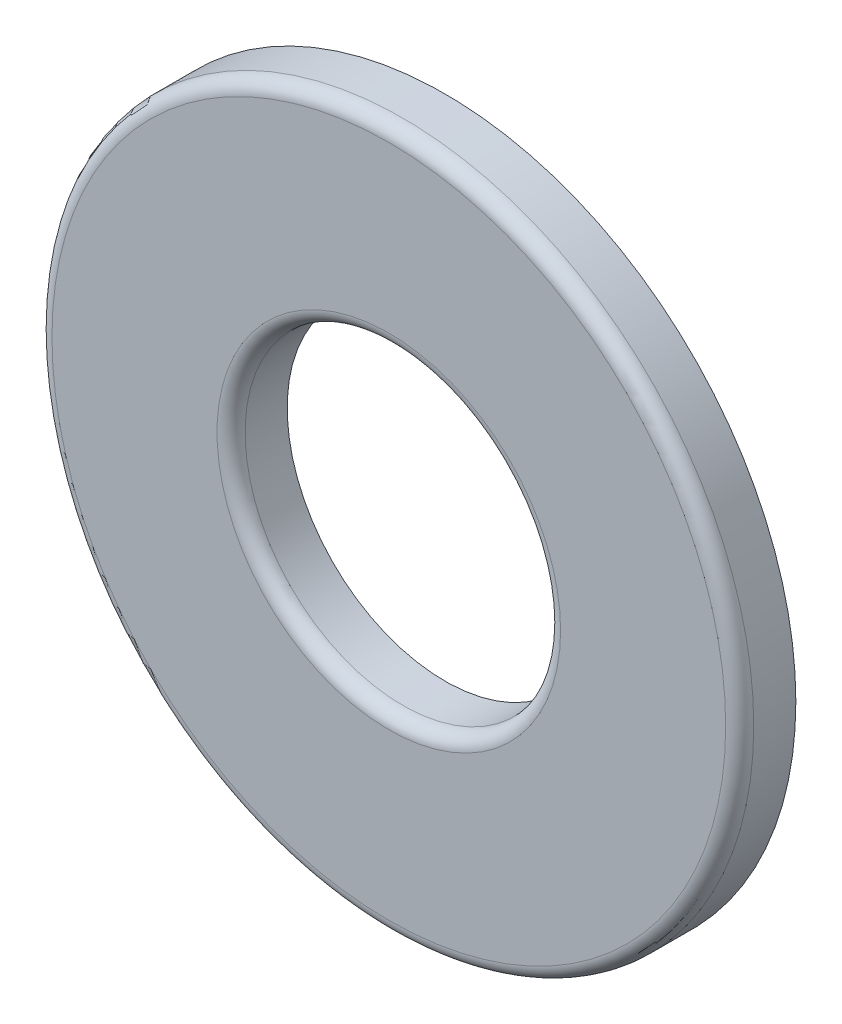
ISO-10303-21;
HEADER;
FILE_DESCRIPTION(('STEP AP214'),'2;1');
FILE_NAME('part.step','',(''),(''),'','','');
FILE_SCHEMA(('AUTOMOTIVE_DESIGN { 1 0 10303 214 1 1 1 1 }'));
ENDSEC;
DATA;
#1=APPLICATION_CONTEXT('core data for automotive mechanical design processes');
#2=APPLICATION_PROTOCOL_DEFINITION('international standard','automotive_design',2000,#1);
#3=PRODUCT_CONTEXT('',#1,'mechanical');
#4=PRODUCT('Part','Part','',(#3));
#5=PRODUCT_RELATED_PRODUCT_CATEGORY('part','',(#4));
#6=PRODUCT_DEFINITION_FORMATION('','',#4);
#7=PRODUCT_DEFINITION_CONTEXT('part definition',#1,'design');
#8=PRODUCT_DEFINITION('design','',#6,#7);
#9=PRODUCT_DEFINITION_SHAPE('','',#8);
#10=(LENGTH_UNIT() NAMED_UNIT(*) SI_UNIT(.MILLI.,.METRE.));
#11=(NAMED_UNIT(*) PLANE_ANGLE_UNIT() SI_UNIT($,.RADIAN.));
#12=(NAMED_UNIT(*) SI_UNIT($,.STERADIAN.) SOLID_ANGLE_UNIT());
#13=UNCERTAINTY_MEASURE_WITH_UNIT(LENGTH_MEASURE(1.E-05),#10,'distance_accuracy_value','');
#14=(GEOMETRIC_REPRESENTATION_CONTEXT(3) GLOBAL_UNCERTAINTY_ASSIGNED_CONTEXT((#13)) GLOBAL_UNIT_ASSIGNED_CONTEXT((#10,
#11,#12)) REPRESENTATION_CONTEXT('',''));
#15=CARTESIAN_POINT('',(0.,0.,0.));
#16=DIRECTION('',(0.,0.,1.));
#17=DIRECTION('',(1.,0.,0.));
#18=AXIS2_PLACEMENT_3D('',#15,#16,#17);
#19=CARTESIAN_POINT('',(0.,0.,0.634999999999997));
#20=DIRECTION('',(0.,0.,1.));
#21=DIRECTION('',(1.,0.,0.));
#22=AXIS2_PLACEMENT_3D('',#19,#20,#21);
#23=PLANE('',#22);
#24=CARTESIAN_POINT('',(0.,0.,0.634999999999997));
#25=DIRECTION('',(0.,0.,1.));
#26=DIRECTION('',(1.,0.,0.));
#27=AXIS2_PLACEMENT_3D('',#24,#25,#26);
#28=CIRCLE('',#27,7.62);
#29=CARTESIAN_POINT('',(7.62,0.,0.634999999999997));
#30=VERTEX_POINT('',#29);
#31=EDGE_CURVE('E66',#30,#30,#28,.T.);
#32=ORIENTED_EDGE('',*,*,#31,.T.);
#33=EDGE_LOOP('',(#32));
#34=FACE_BOUND('',#33,.T.);
#35=CARTESIAN_POINT('',(0.,0.,0.634999999999997));
#36=DIRECTION('',(0.,0.,1.));
#37=DIRECTION('',(1.,0.,0.));
#38=AXIS2_PLACEMENT_3D('',#35,#36,#37);
#39=CIRCLE('',#38,3.8862);
#40=CARTESIAN_POINT('',(3.8862,0.,0.634999999999997));
#41=VERTEX_POINT('',#40);
#42=EDGE_CURVE('E71',#41,#41,#39,.F.);
#43=ORIENTED_EDGE('',*,*,#42,.T.);
#44=EDGE_LOOP('',(#43));
#45=FACE_BOUND('',#44,.T.);
#46=ADVANCED_FACE('F53',(#34,#45),#23,.T.);
#47=CARTESIAN_POINT('',(0.,0.,0.634999999999997));
#48=DIRECTION('',(0.,0.,-1.));
#49=DIRECTION('',(-1.,0.,0.));
#50=AXIS2_PLACEMENT_3D('',#47,#48,#49);
#51=CYLINDRICAL_SURFACE('',#50,7.9375);
#52=CARTESIAN_POINT('',(0.,0.,0.317499999999997));
#53=DIRECTION('',(0.,0.,1.));
#54=DIRECTION('',(1.,0.,0.));
#55=AXIS2_PLACEMENT_3D('',#52,#53,#54);
#56=CIRCLE('',#55,7.9375);
#57=CARTESIAN_POINT('',(7.9375,0.,0.317499999999997));
#58=VERTEX_POINT('',#57);
#59=EDGE_CURVE('E61',#58,#58,#56,.F.);
#60=ORIENTED_EDGE('',*,*,#59,.T.);
#61=EDGE_LOOP('',(#60));
#62=FACE_BOUND('',#61,.T.);
#63=CARTESIAN_POINT('',(0.,0.,-0.635000000000003));
#64=DIRECTION('',(0.,0.,1.));
#65=DIRECTION('',(1.,0.,0.));
#66=AXIS2_PLACEMENT_3D('',#63,#64,#65);
#67=CIRCLE('',#66,7.9375);
#68=CARTESIAN_POINT('',(7.9375,0.,-0.635000000000003));
#69=VERTEX_POINT('',#68);
#70=EDGE_CURVE('E77',#69,#69,#67,.T.);
#71=ORIENTED_EDGE('',*,*,#70,.T.);
#72=EDGE_LOOP('',(#71));
#73=FACE_BOUND('',#72,.T.);
#74=ADVANCED_FACE('F91',(#62,#73),#51,.T.);
#75=CARTESIAN_POINT('',(0.,0.,0.634999999999997));
#76=DIRECTION('',(0.,0.,-1.));
#77=DIRECTION('',(-1.,0.,0.));
#78=AXIS2_PLACEMENT_3D('',#75,#76,#77);
#79=CYLINDRICAL_SURFACE('',#78,3.5687);
#80=CARTESIAN_POINT('',(0.,0.,0.317499999999997));
#81=DIRECTION('',(0.,0.,1.));
#82=DIRECTION('',(1.,0.,0.));
#83=AXIS2_PLACEMENT_3D('',#80,#81,#82);
#84=CIRCLE('',#83,3.5687);
#85=CARTESIAN_POINT('',(3.5687,0.,0.317499999999997));
#86=VERTEX_POINT('',#85);
#87=EDGE_CURVE('E12',#86,#86,#84,.T.);
#88=ORIENTED_EDGE('',*,*,#87,.T.);
#89=EDGE_LOOP('',(#88));
#90=FACE_BOUND('',#89,.T.);
#91=CARTESIAN_POINT('',(0.,0.,-0.635000000000003));
#92=DIRECTION('',(0.,0.,1.));
#93=DIRECTION('',(1.,0.,0.));
#94=AXIS2_PLACEMENT_3D('',#91,#92,#93);
#95=CIRCLE('',#94,3.5687);
#96=CARTESIAN_POINT('',(3.5687,0.,-0.635000000000003));
#97=VERTEX_POINT('',#96);
#98=EDGE_CURVE('E81',#97,#97,#95,.T.);
#99=ORIENTED_EDGE('',*,*,#98,.F.);
#100=EDGE_LOOP('',(#99));
#101=FACE_BOUND('',#100,.T.);
#102=ADVANCED_FACE('F89',(#90,#101),#79,.F.);
#103=CARTESIAN_POINT('',(0.,0.,-0.635000000000003));
#104=DIRECTION('',(0.,0.,1.));
#105=DIRECTION('',(1.,0.,0.));
#106=AXIS2_PLACEMENT_3D('',#103,#104,#105);
#107=PLANE('',#106);
#108=ORIENTED_EDGE('',*,*,#98,.T.);
#109=EDGE_LOOP('',(#108));
#110=FACE_BOUND('',#109,.T.);
#111=ORIENTED_EDGE('',*,*,#70,.F.);
#112=EDGE_LOOP('',(#111));
#113=FACE_BOUND('',#112,.T.);
#114=ADVANCED_FACE('F86',(#110,#113),#107,.F.);
#115=CARTESIAN_POINT('',(0.,0.,0.317499999999997));
#116=DIRECTION('',(0.,0.,1.));
#117=DIRECTION('',(1.,0.,0.));
#118=AXIS2_PLACEMENT_3D('',#115,#116,#117);
#119=TOROIDAL_SURFACE('',#118,7.62,0.3175);
#120=ORIENTED_EDGE('',*,*,#59,.F.);
#121=EDGE_LOOP('',(#120));
#122=FACE_BOUND('',#121,.T.);
#123=ORIENTED_EDGE('',*,*,#31,.F.);
#124=EDGE_LOOP('',(#123));
#125=FACE_BOUND('',#124,.T.);
#126=ADVANCED_FACE('F97',(#122,#125),#119,.T.);
#127=CARTESIAN_POINT('',(0.,0.,0.317499999999997));
#128=DIRECTION('',(0.,0.,1.));
#129=DIRECTION('',(1.,0.,0.));
#130=AXIS2_PLACEMENT_3D('',#127,#128,#129);
#131=TOROIDAL_SURFACE('',#130,3.8862,0.3175);
#132=ORIENTED_EDGE('',*,*,#42,.F.);
#133=EDGE_LOOP('',(#132));
#134=FACE_BOUND('',#133,.T.);
#135=ORIENTED_EDGE('',*,*,#87,.F.);
#136=EDGE_LOOP('',(#135));
#137=FACE_BOUND('',#136,.T.);
#138=ADVANCED_FACE('F55',(#134,#137),#131,.T.);
#139=CLOSED_SHELL('',(#46,#74,#102,#114,#126,#138));
#140=MANIFOLD_SOLID_BREP('B2',#139);
#141=ADVANCED_BREP_SHAPE_REPRESENTATION('',(#18,#140),#14);
#142=SHAPE_DEFINITION_REPRESENTATION(#9,#141);
ENDSEC;
END-ISO-10303-21;
